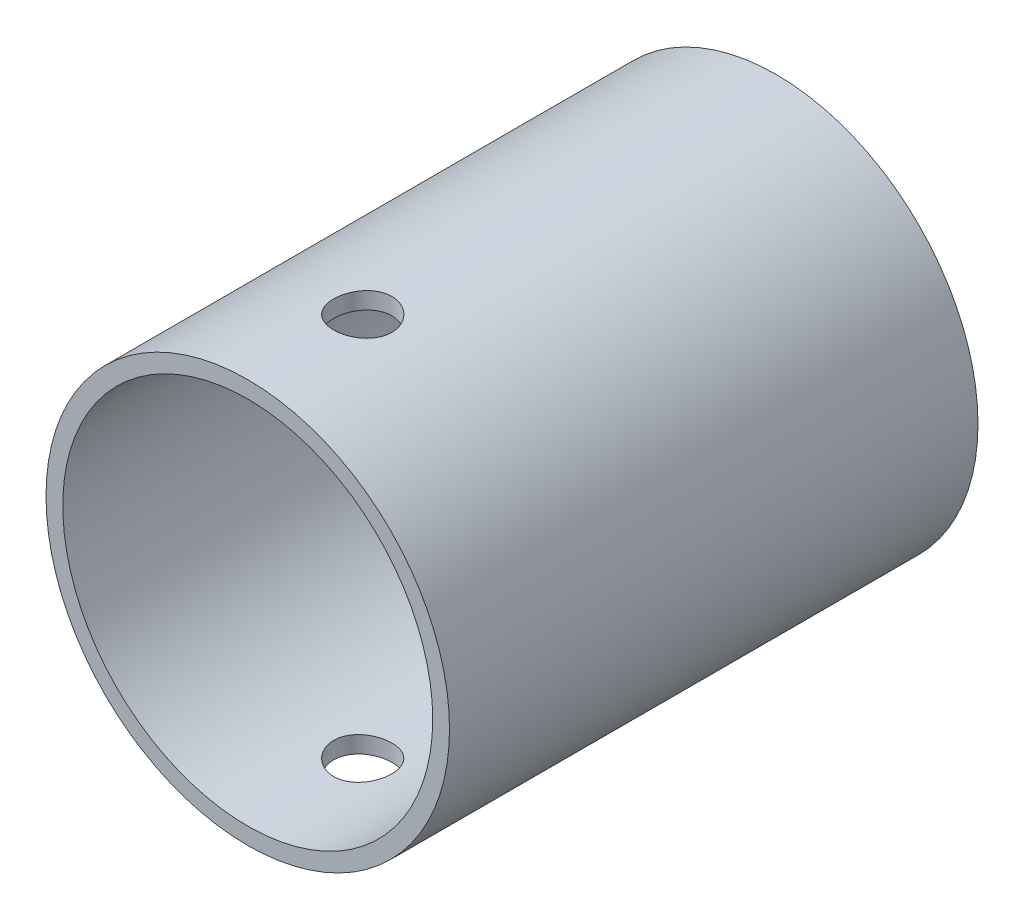
ISO-10303-21;
HEADER;
FILE_DESCRIPTION(('STEP AP214'),'2;1');
FILE_NAME('part.step','',(''),(''),'','','');
FILE_SCHEMA(('AUTOMOTIVE_DESIGN { 1 0 10303 214 1 1 1 1 }'));
ENDSEC;
DATA;
#1=APPLICATION_CONTEXT('core data for automotive mechanical design processes');
#2=APPLICATION_PROTOCOL_DEFINITION('international standard','automotive_design',2000,#1);
#3=PRODUCT_CONTEXT('',#1,'mechanical');
#4=PRODUCT('Part','Part','',(#3));
#5=PRODUCT_RELATED_PRODUCT_CATEGORY('part','',(#4));
#6=PRODUCT_DEFINITION_FORMATION('','',#4);
#7=PRODUCT_DEFINITION_CONTEXT('part definition',#1,'design');
#8=PRODUCT_DEFINITION('design','',#6,#7);
#9=PRODUCT_DEFINITION_SHAPE('','',#8);
#10=(LENGTH_UNIT() NAMED_UNIT(*) SI_UNIT(.MILLI.,.METRE.));
#11=(NAMED_UNIT(*) PLANE_ANGLE_UNIT() SI_UNIT($,.RADIAN.));
#12=(NAMED_UNIT(*) SI_UNIT($,.STERADIAN.) SOLID_ANGLE_UNIT());
#13=UNCERTAINTY_MEASURE_WITH_UNIT(LENGTH_MEASURE(1.E-05),#10,'distance_accuracy_value','');
#14=(GEOMETRIC_REPRESENTATION_CONTEXT(3) GLOBAL_UNCERTAINTY_ASSIGNED_CONTEXT((#13)) GLOBAL_UNIT_ASSIGNED_CONTEXT((#10,
#11,#12)) REPRESENTATION_CONTEXT('',''));
#15=CARTESIAN_POINT('',(0.,0.,0.));
#16=DIRECTION('',(0.,0.,1.));
#17=DIRECTION('',(1.,0.,0.));
#18=AXIS2_PLACEMENT_3D('',#15,#16,#17);
#19=CARTESIAN_POINT('',(0.,0.,6.));
#20=DIRECTION('',(0.,0.,1.));
#21=DIRECTION('',(1.,0.,0.));
#22=AXIS2_PLACEMENT_3D('',#19,#20,#21);
#23=PLANE('',#22);
#24=CARTESIAN_POINT('',(0.,0.,6.));
#25=DIRECTION('',(0.,0.,1.));
#26=DIRECTION('',(1.,0.,0.));
#27=AXIS2_PLACEMENT_3D('',#24,#25,#26);
#28=CIRCLE('',#27,9.);
#29=CARTESIAN_POINT('',(9.,0.,6.));
#30=VERTEX_POINT('',#29);
#31=EDGE_CURVE('E132',#30,#30,#28,.T.);
#32=ORIENTED_EDGE('',*,*,#31,.F.);
#33=EDGE_LOOP('',(#32));
#34=FACE_BOUND('',#33,.T.);
#35=CARTESIAN_POINT('',(0.,0.,6.));
#36=DIRECTION('',(0.,0.,1.));
#37=DIRECTION('',(1.,0.,0.));
#38=AXIS2_PLACEMENT_3D('',#35,#36,#37);
#39=CIRCLE('',#38,10.);
#40=CARTESIAN_POINT('',(10.,0.,6.));
#41=VERTEX_POINT('',#40);
#42=EDGE_CURVE('E54',#41,#41,#39,.F.);
#43=ORIENTED_EDGE('',*,*,#42,.F.);
#44=EDGE_LOOP('',(#43));
#45=FACE_BOUND('',#44,.T.);
#46=ADVANCED_FACE('F34',(#34,#45),#23,.T.);
#47=CARTESIAN_POINT('',(0.,0.,5.));
#48=DIRECTION('',(0.,0.,-1.));
#49=DIRECTION('',(-1.,0.,0.));
#50=AXIS2_PLACEMENT_3D('',#47,#48,#49);
#51=PLANE('',#50);
#52=CARTESIAN_POINT('',(0.,0.,5.));
#53=DIRECTION('',(0.,0.,-1.));
#54=DIRECTION('',(-1.,0.,0.));
#55=AXIS2_PLACEMENT_3D('',#52,#53,#54);
#56=CIRCLE('',#55,6.);
#57=CARTESIAN_POINT('',(-6.,0.,5.));
#58=VERTEX_POINT('',#57);
#59=EDGE_CURVE('E128',#58,#58,#56,.T.);
#60=ORIENTED_EDGE('',*,*,#59,.T.);
#61=EDGE_LOOP('',(#60));
#62=FACE_BOUND('',#61,.T.);
#63=CARTESIAN_POINT('',(0.,0.,5.));
#64=DIRECTION('',(0.,0.,1.));
#65=DIRECTION('',(1.,0.,0.));
#66=AXIS2_PLACEMENT_3D('',#63,#64,#65);
#67=CIRCLE('',#66,9.);
#68=CARTESIAN_POINT('',(9.,0.,5.));
#69=VERTEX_POINT('',#68);
#70=EDGE_CURVE('E137',#69,#69,#67,.T.);
#71=ORIENTED_EDGE('',*,*,#70,.T.);
#72=EDGE_LOOP('',(#71));
#73=FACE_BOUND('',#72,.T.);
#74=ADVANCED_FACE('F92',(#62,#73),#51,.F.);
#75=CARTESIAN_POINT('',(0.,0.,50.));
#76=DIRECTION('',(0.,0.,-1.));
#77=DIRECTION('',(-1.,0.,0.));
#78=AXIS2_PLACEMENT_3D('',#75,#76,#77);
#79=CYLINDRICAL_SURFACE('',#78,17.5);
#80=CARTESIAN_POINT('',(0.,-17.5,41.8700003922223));
#81=CARTESIAN_POINT('',(0.153455229582551,-17.4999974630045,41.8699941337384));
#82=CARTESIAN_POINT('',(0.306997303591635,-17.4979604565219,41.8571123767081));
#83=CARTESIAN_POINT('',(0.609783625449626,-17.4900305238574,41.8059422330934));
#84=CARTESIAN_POINT('',(0.759023644274631,-17.4841339300814,41.767629680265));
#85=CARTESIAN_POINT('',(1.04878062656791,-17.469146941984,41.6667761464509));
#86=CARTESIAN_POINT('',(1.18930431030421,-17.4600590450865,41.6042541072099));
#87=CARTESIAN_POINT('',(1.4578461688781,-17.4396915891876,41.4568040653463));
#88=CARTESIAN_POINT('',(1.58586594948107,-17.4284123121633,41.3718789449507));
#89=CARTESIAN_POINT('',(1.82687936824554,-17.4048070423709,41.1812611533715));
#90=CARTESIAN_POINT('',(1.93975072674967,-17.3924737106769,41.0754147665861));
#91=CARTESIAN_POINT('',(2.14620776085764,-17.368207284657,40.8462898676752));
#92=CARTESIAN_POINT('',(2.23979228333447,-17.3562742142977,40.723010313993));
#93=CARTESIAN_POINT('',(2.40550105052376,-17.3340882849669,40.4616891842459));
#94=CARTESIAN_POINT('',(2.47750588810652,-17.3238449109296,40.323571014526));
#95=CARTESIAN_POINT('',(2.59724804353714,-17.3062990761218,40.0370128344823));
#96=CARTESIAN_POINT('',(2.64498681482154,-17.2989964392188,39.8885734429624));
#97=CARTESIAN_POINT('',(2.71445962258402,-17.2882314601016,39.5868768602009));
#98=CARTESIAN_POINT('',(2.73640375950366,-17.2847381079426,39.4336691765623));
#99=CARTESIAN_POINT('',(2.75431548537907,-17.281893232641,39.12570940022));
#100=CARTESIAN_POINT('',(2.75028470959802,-17.2825414487639,38.9709574053517));
#101=CARTESIAN_POINT('',(2.71653249105086,-17.2878781308041,38.665792501426));
#102=CARTESIAN_POINT('',(2.68704588428737,-17.2925296639804,38.5153528794389));
#103=CARTESIAN_POINT('',(2.60358701785442,-17.3052911276942,38.221583204165));
#104=CARTESIAN_POINT('',(2.54961400397372,-17.3134011647574,38.0782533700192));
#105=CARTESIAN_POINT('',(2.41847274313756,-17.3322062618977,37.8020621568788));
#106=CARTESIAN_POINT('',(2.3412058407861,-17.3429122780869,37.669248398068));
#107=CARTESIAN_POINT('',(2.16574029562039,-17.3656952499611,37.4183824011052));
#108=CARTESIAN_POINT('',(2.06754014737257,-17.3777723042165,37.3003312255872));
#109=CARTESIAN_POINT('',(1.85171057236304,-17.4020993832948,37.0809811054065));
#110=CARTESIAN_POINT('',(1.7338794134433,-17.4143498500481,36.979880598823));
#111=CARTESIAN_POINT('',(1.48281796103276,-17.4375203725031,36.798858256409));
#112=CARTESIAN_POINT('',(1.34958758767357,-17.4484404213039,36.7189365304298));
#113=CARTESIAN_POINT('',(1.07133156137927,-17.4677327717946,36.5825269724027));
#114=CARTESIAN_POINT('',(0.926297820339916,-17.4761033075165,36.5260553737314));
#115=CARTESIAN_POINT('',(0.628644132738795,-17.4893389966959,36.4383264400927));
#116=CARTESIAN_POINT('',(0.476024750473814,-17.4942044104837,36.4070672325438));
#117=CARTESIAN_POINT('',(0.169243780415673,-17.4998469580502,36.3709164208083));
#118=CARTESIAN_POINT('',(0.0151150703929344,-17.5006663632781,36.3657521711964));
#119=CARTESIAN_POINT('',(-0.29180648376779,-17.4982399319457,36.3812128531373));
#120=CARTESIAN_POINT('',(-0.4445993732436,-17.4949942338987,36.401836905985));
#121=CARTESIAN_POINT('',(-0.743679422530946,-17.4848284353516,36.4680620039074));
#122=CARTESIAN_POINT('',(-0.889996919858359,-17.4779280136421,36.5135293219911));
#123=CARTESIAN_POINT('',(-1.17293227179733,-17.4612237098417,36.628008640138));
#124=CARTESIAN_POINT('',(-1.30954963259971,-17.4514196800667,36.697021837825));
#125=CARTESIAN_POINT('',(-1.57039946776912,-17.4298918578239,36.8572671921913));
#126=CARTESIAN_POINT('',(-1.69452514146822,-17.4181534584848,36.9486712014796));
#127=CARTESIAN_POINT('',(-1.92577278652917,-17.3941064929383,37.1508654890616));
#128=CARTESIAN_POINT('',(-2.03289366682977,-17.3817978902109,37.2616570103385));
#129=CARTESIAN_POINT('',(-2.22809077542299,-17.3578626272195,37.5006989512705));
#130=CARTESIAN_POINT('',(-2.31598362633745,-17.3462432437313,37.6290999545737));
#131=CARTESIAN_POINT('',(-2.46895256595108,-17.3251337935183,37.8990037750657));
#132=CARTESIAN_POINT('',(-2.53402931720837,-17.3156436649648,38.0405062116502));
#133=CARTESIAN_POINT('',(-2.63923867768394,-17.2999207265537,38.3320635521373));
#134=CARTESIAN_POINT('',(-2.67946560939592,-17.2936756141117,38.4820837264695));
#135=CARTESIAN_POINT('',(-2.73413229043844,-17.285117855811,38.7868569262007));
#136=CARTESIAN_POINT('',(-2.74857401062851,-17.2828049094027,38.9416095889583));
#137=CARTESIAN_POINT('',(-2.75121005923864,-17.2823853149773,39.2496257804446));
#138=CARTESIAN_POINT('',(-2.73969283943861,-17.2842324406975,39.4028868548955));
#139=CARTESIAN_POINT('',(-2.69135840320221,-17.2918240499717,39.7052627646104));
#140=CARTESIAN_POINT('',(-2.65454124370756,-17.297568524754,39.8543776092054));
#141=CARTESIAN_POINT('',(-2.55675761537021,-17.3122908254171,40.1441351076097));
#142=CARTESIAN_POINT('',(-2.49581326154319,-17.3212656896368,40.2847853844235));
#143=CARTESIAN_POINT('',(-2.35153428014303,-17.3414408094226,40.5539115750985));
#144=CARTESIAN_POINT('',(-2.2681987464252,-17.3526411550466,40.6823869959729));
#145=CARTESIAN_POINT('',(-2.08046265805288,-17.3761530141985,40.9249787203767));
#146=CARTESIAN_POINT('',(-1.97584903731687,-17.3884750087046,41.0389291422424));
#147=CARTESIAN_POINT('',(-1.74897653539545,-17.4127559241292,41.2477584911066));
#148=CARTESIAN_POINT('',(-1.62671357218263,-17.4247147602782,41.3426329939518));
#149=CARTESIAN_POINT('',(-1.36713472210832,-17.4470054845769,41.5111377614422));
#150=CARTESIAN_POINT('',(-1.22973187787683,-17.4573270446582,41.5846354278861));
#151=CARTESIAN_POINT('',(-0.944429950548835,-17.4750794072139,41.7073966727562));
#152=CARTESIAN_POINT('',(-0.796541742404635,-17.4825131544018,41.7566849512202));
#153=CARTESIAN_POINT('',(-0.540021805161799,-17.491986366102,41.8186469990022));
#154=CARTESIAN_POINT('',(-0.432960829499724,-17.4949757850587,41.837874509043));
#155=CARTESIAN_POINT('',(-0.217281069280105,-17.4989834861277,41.8635533300353));
#156=CARTESIAN_POINT('',(-0.108662307045458,-17.5000017964574,41.8700048238817));
#157=CARTESIAN_POINT('',(0.,-17.5,41.8700003922223));
#158=B_SPLINE_CURVE_WITH_KNOTS('',3,(#80,#81,#82,#83,#84,#85,#86,#87,#88,#89,#90,#91,#92,#93,
#94,#95,#96,#97,#98,#99,#100,#101,#102,#103,#104,#105,#106,#107,#108,#109,#110,#111,#112,#113,
#114,#115,#116,#117,#118,#119,#120,#121,#122,#123,#124,#125,#126,#127,#128,#129,#130,#131,#132,
#133,#134,#135,#136,#137,#138,#139,#140,#141,#142,#143,#144,#145,#146,#147,#148,#149,#150,#151,
#152,#153,#154,#155,#156,#157),.UNSPECIFIED.,.T.,.F.,(4,2,2,2,2,2,2,2,2,2,2,2,2,2,2,2,2,2,2,2,2,
2,2,2,2,2,2,2,2,2,2,2,2,2,2,2,2,2,4),(0.,0.459968572164253,0.920374867822618,1.38042166249811,
1.84040929954923,2.30391144436546,2.76744129314947,3.2334905525743,3.69951189429492,
4.1617105385927,4.62388008523577,5.08183102452064,5.5397960702116,5.99972863003873,
6.45969427750327,6.92471667887331,7.38974149220079,7.85508768497432,8.320399312248,
8.78083906741796,9.24126313409204,9.69923288986304,10.1572259430135,10.6188507976519,
11.0805052590953,11.546387163941,12.0122555388924,12.4763445730229,12.9403981335855,
13.3993206543928,13.8582421423223,14.3167439525829,14.7752643206676,15.2386245857692,
15.7020921913456,16.1683761500298,16.6341833812816,16.9598937651968,17.2855994863752),.UNSPECIFIED.);
#159=CARTESIAN_POINT('',(0.,-17.5,41.8700003922223));
#160=VERTEX_POINT('',#159);
#161=EDGE_CURVE('E81',#160,#160,#158,.T.);
#162=ORIENTED_EDGE('',*,*,#161,.F.);
#163=EDGE_LOOP('',(#162));
#164=FACE_BOUND('',#163,.T.);
#165=CARTESIAN_POINT('',(0.,17.5,36.3700003922224));
#166=CARTESIAN_POINT('',(0.153455229582551,17.4999974630045,36.3700066507063));
#167=CARTESIAN_POINT('',(0.306997303591635,17.4979604565219,36.3828884077366));
#168=CARTESIAN_POINT('',(0.609783625449626,17.4900305238574,36.4340585513513));
#169=CARTESIAN_POINT('',(0.759023644274631,17.4841339300814,36.4723711041797));
#170=CARTESIAN_POINT('',(1.04878062656791,17.469146941984,36.5732246379938));
#171=CARTESIAN_POINT('',(1.18930431030421,17.4600590450865,36.6357466772348));
#172=CARTESIAN_POINT('',(1.4578461688781,17.4396915891876,36.7831967190983));
#173=CARTESIAN_POINT('',(1.58586594948107,17.4284123121633,36.868121839494));
#174=CARTESIAN_POINT('',(1.82687936824554,17.4048070423709,37.0587396310732));
#175=CARTESIAN_POINT('',(1.93975072674967,17.3924737106769,37.1645860178586));
#176=CARTESIAN_POINT('',(2.14620776085764,17.368207284657,37.3937109167695));
#177=CARTESIAN_POINT('',(2.23979228333447,17.3562742142977,37.5169904704517));
#178=CARTESIAN_POINT('',(2.40550105052376,17.3340882849669,37.7783116001988));
#179=CARTESIAN_POINT('',(2.47750588810652,17.3238449109296,37.9164297699187));
#180=CARTESIAN_POINT('',(2.59724804353714,17.3062990761218,38.2029879499624));
#181=CARTESIAN_POINT('',(2.64498681482154,17.2989964392188,38.3514273414823));
#182=CARTESIAN_POINT('',(2.71445962258402,17.2882314601016,38.6531239242438));
#183=CARTESIAN_POINT('',(2.73640375950366,17.2847381079426,38.8063316078824));
#184=CARTESIAN_POINT('',(2.75431548537907,17.281893232641,39.1142913842247));
#185=CARTESIAN_POINT('',(2.75028470959802,17.2825414487639,39.269043379093));
#186=CARTESIAN_POINT('',(2.71653249105086,17.2878781308041,39.5742082830187));
#187=CARTESIAN_POINT('',(2.68704588428737,17.2925296639804,39.7246479050058));
#188=CARTESIAN_POINT('',(2.60358701785442,17.3052911276942,40.0184175802797));
#189=CARTESIAN_POINT('',(2.54961400397372,17.3134011647574,40.1617474144255));
#190=CARTESIAN_POINT('',(2.41847274313756,17.3322062618977,40.4379386275659));
#191=CARTESIAN_POINT('',(2.3412058407861,17.3429122780869,40.5707523863767));
#192=CARTESIAN_POINT('',(2.16574029562039,17.3656952499611,40.8216183833395));
#193=CARTESIAN_POINT('',(2.06754014737257,17.3777723042165,40.9396695588575));
#194=CARTESIAN_POINT('',(1.85171057236304,17.4020993832948,41.1590196790382));
#195=CARTESIAN_POINT('',(1.7338794134433,17.4143498500481,41.2601201856217));
#196=CARTESIAN_POINT('',(1.48281796103276,17.4375203725031,41.4411425280357));
#197=CARTESIAN_POINT('',(1.34958758767357,17.4484404213039,41.5210642540149));
#198=CARTESIAN_POINT('',(1.07133156137927,17.4677327717946,41.657473812042));
#199=CARTESIAN_POINT('',(0.926297820339916,17.4761033075165,41.7139454107133));
#200=CARTESIAN_POINT('',(0.628644132738795,17.4893389966959,41.801674344352));
#201=CARTESIAN_POINT('',(0.476024750473814,17.4942044104837,41.8329335519009));
#202=CARTESIAN_POINT('',(0.169243780415673,17.4998469580502,41.8690843636364));
#203=CARTESIAN_POINT('',(0.0151150703929341,17.5006663632781,41.8742486132482));
#204=CARTESIAN_POINT('',(-0.29180648376779,17.4982399319457,41.8587879313074));
#205=CARTESIAN_POINT('',(-0.4445993732436,17.4949942338987,41.8381638784597));
#206=CARTESIAN_POINT('',(-0.743679422530946,17.4848284353516,41.7719387805373));
#207=CARTESIAN_POINT('',(-0.889996919858359,17.4779280136421,41.7264714624536));
#208=CARTESIAN_POINT('',(-1.17293227179733,17.4612237098417,41.6119921443067));
#209=CARTESIAN_POINT('',(-1.30954963259971,17.4514196800667,41.5429789466197));
#210=CARTESIAN_POINT('',(-1.57039946776912,17.4298918578239,41.3827335922534));
#211=CARTESIAN_POINT('',(-1.69452514146822,17.4181534584848,41.2913295829651));
#212=CARTESIAN_POINT('',(-1.92577278652918,17.3941064929383,41.0891352953831));
#213=CARTESIAN_POINT('',(-2.03289366682977,17.3817978902109,40.9783437741062));
#214=CARTESIAN_POINT('',(-2.22809077542299,17.3578626272195,40.7393018331742));
#215=CARTESIAN_POINT('',(-2.31598362633745,17.3462432437313,40.610900829871));
#216=CARTESIAN_POINT('',(-2.46895256595108,17.3251337935183,40.340997009379));
#217=CARTESIAN_POINT('',(-2.53402931720837,17.3156436649648,40.1994945727945));
#218=CARTESIAN_POINT('',(-2.63923867768394,17.2999207265537,39.9079372323074));
#219=CARTESIAN_POINT('',(-2.67946560939592,17.2936756141117,39.7579170579752));
#220=CARTESIAN_POINT('',(-2.73413229043844,17.285117855811,39.453143858244));
#221=CARTESIAN_POINT('',(-2.74857401062851,17.2828049094027,39.2983911954864));
#222=CARTESIAN_POINT('',(-2.75121005923864,17.2823853149773,38.9903750040001));
#223=CARTESIAN_POINT('',(-2.73969283943861,17.2842324406975,38.8371139295492));
#224=CARTESIAN_POINT('',(-2.69135840320221,17.2918240499717,38.5347380198343));
#225=CARTESIAN_POINT('',(-2.65454124370756,17.297568524754,38.3856231752393));
#226=CARTESIAN_POINT('',(-2.55675761537021,17.3122908254171,38.095865676835));
#227=CARTESIAN_POINT('',(-2.49581326154319,17.3212656896368,37.9552154000212));
#228=CARTESIAN_POINT('',(-2.35153428014303,17.3414408094226,37.6860892093462));
#229=CARTESIAN_POINT('',(-2.2681987464252,17.3526411550466,37.5576137884718));
#230=CARTESIAN_POINT('',(-2.08046265805288,17.3761530141985,37.315022064068));
#231=CARTESIAN_POINT('',(-1.97584903731687,17.3884750087046,37.2010716422023));
#232=CARTESIAN_POINT('',(-1.74897653539545,17.4127559241292,36.9922422933381));
#233=CARTESIAN_POINT('',(-1.62671357218263,17.4247147602782,36.8973677904929));
#234=CARTESIAN_POINT('',(-1.36713472210832,17.4470054845769,36.7288630230025));
#235=CARTESIAN_POINT('',(-1.22973187787683,17.4573270446582,36.6553653565586));
#236=CARTESIAN_POINT('',(-0.944429950548835,17.4750794072139,36.5326041116885));
#237=CARTESIAN_POINT('',(-0.796541742404635,17.4825131544018,36.4833158332245));
#238=CARTESIAN_POINT('',(-0.540021805161799,17.491986366102,36.4213537854425));
#239=CARTESIAN_POINT('',(-0.432960829499724,17.4949757850587,36.4021262754017));
#240=CARTESIAN_POINT('',(-0.217281069280105,17.4989834861277,36.3764474544094));
#241=CARTESIAN_POINT('',(-0.108662307045458,17.5000017964574,36.369995960563));
#242=CARTESIAN_POINT('',(0.,17.5,36.3700003922224));
#243=B_SPLINE_CURVE_WITH_KNOTS('',3,(#165,#166,#167,#168,#169,#170,#171,#172,#173,#174,#175,
#176,#177,#178,#179,#180,#181,#182,#183,#184,#185,#186,#187,#188,#189,#190,#191,#192,#193,#194,
#195,#196,#197,#198,#199,#200,#201,#202,#203,#204,#205,#206,#207,#208,#209,#210,#211,#212,#213,
#214,#215,#216,#217,#218,#219,#220,#221,#222,#223,#224,#225,#226,#227,#228,#229,#230,#231,#232,
#233,#234,#235,#236,#237,#238,#239,#240,#241,#242),.UNSPECIFIED.,.T.,.F.,(4,2,2,2,2,2,2,2,2,2,2,
2,2,2,2,2,2,2,2,2,2,2,2,2,2,2,2,2,2,2,2,2,2,2,2,2,2,2,4),(0.,0.459968572164253,
0.920374867822618,1.38042166249811,1.84040929954923,2.30391144436546,2.76744129314947,
3.2334905525743,3.69951189429492,4.16171053859271,4.62388008523577,5.08183102452064,
5.5397960702116,5.99972863003873,6.45969427750327,6.92471667887331,7.38974149220079,
7.85508768497432,8.320399312248,8.78083906741796,9.24126313409204,9.69923288986304,
10.1572259430135,10.6188507976519,11.0805052590953,11.546387163941,12.0122555388924,
12.4763445730229,12.9403981335855,13.3993206543928,13.8582421423222,14.3167439525829,
14.7752643206676,15.2386245857692,15.7020921913456,16.1683761500298,16.6341833812816,
16.9598937651968,17.2855994863752),.UNSPECIFIED.);
#244=CARTESIAN_POINT('',(0.,17.5,36.3700003922224));
#245=VERTEX_POINT('',#244);
#246=EDGE_CURVE('E72',#245,#245,#243,.T.);
#247=ORIENTED_EDGE('',*,*,#246,.F.);
#248=EDGE_LOOP('',(#247));
#249=FACE_BOUND('',#248,.T.);
#250=CARTESIAN_POINT('',(0.,0.,18.));
#251=DIRECTION('',(0.,0.,1.));
#252=DIRECTION('',(1.,0.,0.));
#253=AXIS2_PLACEMENT_3D('',#250,#251,#252);
#254=CIRCLE('',#253,17.5);
#255=CARTESIAN_POINT('',(17.5,0.,18.));
#256=VERTEX_POINT('',#255);
#257=EDGE_CURVE('E50',#256,#256,#254,.T.);
#258=ORIENTED_EDGE('',*,*,#257,.F.);
#259=EDGE_LOOP('',(#258));
#260=FACE_BOUND('',#259,.T.);
#261=CARTESIAN_POINT('',(0.,0.,50.));
#262=DIRECTION('',(0.,0.,1.));
#263=DIRECTION('',(1.,0.,0.));
#264=AXIS2_PLACEMENT_3D('',#261,#262,#263);
#265=CIRCLE('',#264,17.5);
#266=CARTESIAN_POINT('',(17.5,0.,50.));
#267=VERTEX_POINT('',#266);
#268=EDGE_CURVE('E134',#267,#267,#265,.T.);
#269=ORIENTED_EDGE('',*,*,#268,.T.);
#270=EDGE_LOOP('',(#269));
#271=FACE_BOUND('',#270,.T.);
#272=ADVANCED_FACE('F86',(#164,#249,#260,#271),#79,.F.);
#273=CARTESIAN_POINT('',(0.,0.,50.));
#274=DIRECTION('',(0.,0.,1.));
#275=DIRECTION('',(1.,0.,0.));
#276=AXIS2_PLACEMENT_3D('',#273,#274,#275);
#277=PLANE('',#276);
#278=CARTESIAN_POINT('',(0.,0.,50.));
#279=DIRECTION('',(0.,0.,1.));
#280=DIRECTION('',(1.,0.,0.));
#281=AXIS2_PLACEMENT_3D('',#278,#279,#280);
#282=CIRCLE('',#281,19.0875);
#283=CARTESIAN_POINT('',(19.0875,0.,50.));
#284=VERTEX_POINT('',#283);
#285=EDGE_CURVE('E143',#284,#284,#282,.T.);
#286=ORIENTED_EDGE('',*,*,#285,.T.);
#287=EDGE_LOOP('',(#286));
#288=FACE_BOUND('',#287,.T.);
#289=ORIENTED_EDGE('',*,*,#268,.F.);
#290=EDGE_LOOP('',(#289));
#291=FACE_BOUND('',#290,.T.);
#292=ADVANCED_FACE('F91',(#288,#291),#277,.T.);
#293=CARTESIAN_POINT('',(0.,0.,0.));
#294=DIRECTION('',(0.,0.,1.));
#295=DIRECTION('',(1.,0.,0.));
#296=AXIS2_PLACEMENT_3D('',#293,#294,#295);
#297=PLANE('',#296);
#298=CARTESIAN_POINT('',(0.,0.,0.));
#299=DIRECTION('',(0.,0.,1.));
#300=DIRECTION('',(1.,0.,0.));
#301=AXIS2_PLACEMENT_3D('',#298,#299,#300);
#302=CIRCLE('',#301,19.0875);
#303=CARTESIAN_POINT('',(19.0875,0.,0.));
#304=VERTEX_POINT('',#303);
#305=EDGE_CURVE('E142',#304,#304,#302,.T.);
#306=ORIENTED_EDGE('',*,*,#305,.F.);
#307=EDGE_LOOP('',(#306));
#308=FACE_BOUND('',#307,.T.);
#309=CARTESIAN_POINT('',(0.,0.,0.));
#310=DIRECTION('',(0.,0.,-1.));
#311=DIRECTION('',(-1.,0.,0.));
#312=AXIS2_PLACEMENT_3D('',#309,#310,#311);
#313=CIRCLE('',#312,6.);
#314=CARTESIAN_POINT('',(-6.,0.,0.));
#315=VERTEX_POINT('',#314);
#316=EDGE_CURVE('E131',#315,#315,#313,.T.);
#317=ORIENTED_EDGE('',*,*,#316,.F.);
#318=EDGE_LOOP('',(#317));
#319=FACE_BOUND('',#318,.T.);
#320=ADVANCED_FACE('F97',(#308,#319),#297,.F.);
#321=CARTESIAN_POINT('',(0.,0.,50.));
#322=DIRECTION('',(0.,0.,-1.));
#323=DIRECTION('',(-1.,0.,0.));
#324=AXIS2_PLACEMENT_3D('',#321,#322,#323);
#325=CYLINDRICAL_SURFACE('',#324,19.0875);
#326=CARTESIAN_POINT('',(0.,-19.0875,41.8700003922223));
#327=CARTESIAN_POINT('',(0.153615521120521,-19.0874976073508,41.8699940048672));
#328=CARTESIAN_POINT('',(0.307321919414108,-19.0856260886995,41.8570854631101));
#329=CARTESIAN_POINT('',(0.61044325138344,-19.078340322224,41.805802666711));
#330=CARTESIAN_POINT('',(0.759853776449987,-19.0729225616853,41.7674031615706));
#331=CARTESIAN_POINT('',(1.0499523272757,-19.0591535274818,41.6663055363477));
#332=CARTESIAN_POINT('',(1.19064667632898,-19.0508044104449,41.6036252763626));
#333=CARTESIAN_POINT('',(1.45949743002485,-19.0320967554129,41.4557879426475));
#334=CARTESIAN_POINT('',(1.58765567505141,-19.021738513039,41.3706341749872));
#335=CARTESIAN_POINT('',(1.82874567934008,-19.0000819023628,41.1796105408404));
#336=CARTESIAN_POINT('',(1.94157367862009,-18.9887778907905,41.0736103454498));
#337=CARTESIAN_POINT('',(2.14790558010967,-18.9665482758457,40.8441831727678));
#338=CARTESIAN_POINT('',(2.24140840443123,-18.955622693609,40.7207552240657));
#339=CARTESIAN_POINT('',(2.4068354982899,-18.9353320845211,40.4592845205804));
#340=CARTESIAN_POINT('',(2.47866014359806,-18.9259743478301,40.3211781208939));
#341=CARTESIAN_POINT('',(2.59805550551329,-18.909955444476,40.0347050370253));
#342=CARTESIAN_POINT('',(2.64562744099076,-18.9032941423016,39.8863388688949));
#343=CARTESIAN_POINT('',(2.71484640117386,-18.893477480035,39.5846458082018));
#344=CARTESIAN_POINT('',(2.73667050797301,-18.8902981832464,39.4313603374033));
#345=CARTESIAN_POINT('',(2.75432273116317,-18.8877327117754,39.1232723717038));
#346=CARTESIAN_POINT('',(2.75015222628334,-18.8883463359202,38.9684699576946));
#347=CARTESIAN_POINT('',(2.71607848744068,-18.8932754787945,38.6629890180054));
#348=CARTESIAN_POINT('',(2.68637192683781,-18.8975627034194,38.5122880330407));
#349=CARTESIAN_POINT('',(2.60237695257479,-18.9093118080741,38.2180322253942));
#350=CARTESIAN_POINT('',(2.54808789299907,-18.9167737715212,38.0744775905959));
#351=CARTESIAN_POINT('',(2.41626271289395,-18.93406304825,37.797987897475));
#352=CARTESIAN_POINT('',(2.33864274217743,-18.9438988675002,37.6650933710295));
#353=CARTESIAN_POINT('',(2.16241886697989,-18.9648213615543,37.4141409888064));
#354=CARTESIAN_POINT('',(2.06381369054991,-18.9759081121601,37.2960840330492));
#355=CARTESIAN_POINT('',(1.84733623711265,-18.9982084901695,37.0770177086298));
#356=CARTESIAN_POINT('',(1.72929475592141,-19.0094223451599,36.9761754926198));
#357=CARTESIAN_POINT('',(1.47787363335214,-19.03061834793,36.7957081354773));
#358=CARTESIAN_POINT('',(1.34449393387797,-19.0406004910441,36.7160830747123));
#359=CARTESIAN_POINT('',(1.06604169691755,-19.0582176396214,36.5803038517239));
#360=CARTESIAN_POINT('',(0.92096308857828,-19.0658514164373,36.5241619702138));
#361=CARTESIAN_POINT('',(0.623302710085163,-19.0779012587909,36.4370848757042));
#362=CARTESIAN_POINT('',(0.470721408171616,-19.0823175248607,36.4061480917759));
#363=CARTESIAN_POINT('',(0.163830171900698,-19.0874083216805,36.370580216214));
#364=CARTESIAN_POINT('',(0.00954740629092863,-19.0881155545185,36.3657192089349));
#365=CARTESIAN_POINT('',(-0.297630929524714,-19.0857974343763,36.3818314952901));
#366=CARTESIAN_POINT('',(-0.450526539131832,-19.0827721877512,36.4028040528103));
#367=CARTESIAN_POINT('',(-0.749898553796234,-19.0733492726509,36.4697969851133));
#368=CARTESIAN_POINT('',(-0.896400402884331,-19.0669666084194,36.5157059490332));
#369=CARTESIAN_POINT('',(-1.17962713880169,-19.0515424738158,36.6311514399829));
#370=CARTESIAN_POINT('',(-1.31635159731462,-19.0425008870535,36.7006890013397));
#371=CARTESIAN_POINT('',(-1.5771574665485,-19.0226830922841,36.8619614260365));
#372=CARTESIAN_POINT('',(-1.70114736709116,-19.0118955942081,36.9538428649641));
#373=CARTESIAN_POINT('',(-1.93202921337457,-18.9898234846501,37.1569899723744));
#374=CARTESIAN_POINT('',(-2.03892024564451,-18.9785388466503,37.2682566758108));
#375=CARTESIAN_POINT('',(-2.2334014519783,-18.9566413067788,37.5080367511314));
#376=CARTESIAN_POINT('',(-2.32083792662726,-18.9460341957184,37.6366753942108));
#377=CARTESIAN_POINT('',(-2.4728613317025,-18.9267934310252,37.9069486693752));
#378=CARTESIAN_POINT('',(-2.53744884116329,-18.9181597273848,38.0485829720119));
#379=CARTESIAN_POINT('',(-2.6416999885292,-18.9038846687247,38.3403592839205));
#380=CARTESIAN_POINT('',(-2.68144596509198,-18.8982334379287,38.4904713694376));
#381=CARTESIAN_POINT('',(-2.73514871306011,-18.8905364169606,38.7953270816236));
#382=CARTESIAN_POINT('',(-2.74910711604136,-18.8884903986877,38.9500704146446));
#383=CARTESIAN_POINT('',(-2.75080191178507,-18.8882435222291,39.2582648625841));
#384=CARTESIAN_POINT('',(-2.73877990820919,-18.8900072355387,39.4117146754972));
#385=CARTESIAN_POINT('',(-2.68937134673422,-18.8971043105539,39.7143865284613));
#386=CARTESIAN_POINT('',(-2.65198481731345,-18.9024376682515,39.863608573259));
#387=CARTESIAN_POINT('',(-2.5529914660506,-18.9160610713229,40.1535308936064));
#388=CARTESIAN_POINT('',(-2.49140021928185,-18.9243492150551,40.2942365821416));
#389=CARTESIAN_POINT('',(-2.34576966984653,-18.9429508272684,40.5633561231066));
#390=CARTESIAN_POINT('',(-2.26172972649173,-18.953264353552,40.691769624574));
#391=CARTESIAN_POINT('',(-2.07270467337002,-18.974869052824,40.9338891873967));
#392=CARTESIAN_POINT('',(-1.96754028448335,-18.9861680904932,41.0474545967215));
#393=CARTESIAN_POINT('',(-1.73963002813365,-19.0084040647582,41.2554131894042));
#394=CARTESIAN_POINT('',(-1.61688006709496,-19.0193409163123,41.3498018963973));
#395=CARTESIAN_POINT('',(-1.3565560052711,-19.0396830230242,41.5171502173313));
#396=CARTESIAN_POINT('',(-1.21891004789264,-19.0490802495767,41.5899990010265));
#397=CARTESIAN_POINT('',(-0.933269184657702,-19.0652051265391,41.7114368200805));
#398=CARTESIAN_POINT('',(-0.785285318196399,-19.0719355749352,41.7600512960001));
#399=CARTESIAN_POINT('',(-0.530508906074504,-19.080410241401,41.8204565264275));
#400=CARTESIAN_POINT('',(-0.425298265725089,-19.0830554262534,41.8390075181438));
#401=CARTESIAN_POINT('',(-0.213406361091009,-19.0866011270885,41.8637816019122));
#402=CARTESIAN_POINT('',(-0.106725113031621,-19.0875016623044,41.8700048298677));
#403=CARTESIAN_POINT('',(0.,-19.0875,41.8700003922223));
#404=B_SPLINE_CURVE_WITH_KNOTS('',3,(#326,#327,#328,#329,#330,#331,#332,#333,#334,#335,#336,
#337,#338,#339,#340,#341,#342,#343,#344,#345,#346,#347,#348,#349,#350,#351,#352,#353,#354,#355,
#356,#357,#358,#359,#360,#361,#362,#363,#364,#365,#366,#367,#368,#369,#370,#371,#372,#373,#374,
#375,#376,#377,#378,#379,#380,#381,#382,#383,#384,#385,#386,#387,#388,#389,#390,#391,#392,#393,
#394,#395,#396,#397,#398,#399,#400,#401,#402,#403),.UNSPECIFIED.,.T.,.F.,(4,2,2,2,2,2,2,2,2,2,2,
2,2,2,2,2,2,2,2,2,2,2,2,2,2,2,2,2,2,2,2,2,2,2,2,2,2,2,4),(0.,0.460456617825209,0.92137003059068,
1.38194505293461,1.84245235798277,2.3059358668478,2.76944522016562,3.23505333277042,
3.7006380429633,4.16300164846519,4.62534073085565,5.08415055582128,5.54297243690893,
6.00346342962956,6.46398234144444,6.92874575399378,7.39351092697263,7.85851884959101,
8.32349778798203,8.78437008706609,9.24522925413426,9.70404613115434,10.1628830951827,
10.624815311634,11.0867721976,11.5522584710578,12.0177329473982,12.4816562844754,
12.9455502681874,13.4051488661451,13.864746948084,14.3240497741987,14.7833657102664,
15.2467583167256,15.7102589676787,16.1761045663354,16.6414600968217,16.9613680461405,
17.2812724687216),.UNSPECIFIED.);
#405=CARTESIAN_POINT('',(0.,-19.0875,41.8700003922223));
#406=VERTEX_POINT('',#405);
#407=EDGE_CURVE('E10',#406,#406,#404,.T.);
#408=ORIENTED_EDGE('',*,*,#407,.T.);
#409=EDGE_LOOP('',(#408));
#410=FACE_BOUND('',#409,.T.);
#411=CARTESIAN_POINT('',(0.,19.0875,36.3700003922224));
#412=CARTESIAN_POINT('',(0.153615521120521,19.0874976073508,36.3700067795775));
#413=CARTESIAN_POINT('',(0.307321919414108,19.0856260886995,36.3829153213346));
#414=CARTESIAN_POINT('',(0.61044325138344,19.078340322224,36.4341981177337));
#415=CARTESIAN_POINT('',(0.759853776449987,19.0729225616853,36.4725976228741));
#416=CARTESIAN_POINT('',(1.0499523272757,19.0591535274818,36.573695248097));
#417=CARTESIAN_POINT('',(1.19064667632898,19.0508044104449,36.6363755080821));
#418=CARTESIAN_POINT('',(1.45949743002485,19.0320967554129,36.7842128417972));
#419=CARTESIAN_POINT('',(1.58765567505141,19.021738513039,36.8693666094575));
#420=CARTESIAN_POINT('',(1.82874567934008,19.0000819023628,37.0603902436043));
#421=CARTESIAN_POINT('',(1.94157367862009,18.9887778907905,37.1663904389949));
#422=CARTESIAN_POINT('',(2.14790558010967,18.9665482758457,37.3958176116769));
#423=CARTESIAN_POINT('',(2.24140840443123,18.955622693609,37.5192455603789));
#424=CARTESIAN_POINT('',(2.4068354982899,18.9353320845211,37.7807162638643));
#425=CARTESIAN_POINT('',(2.47866014359806,18.9259743478301,37.9188226635508));
#426=CARTESIAN_POINT('',(2.59805550551329,18.909955444476,38.2052957474194));
#427=CARTESIAN_POINT('',(2.64562744099076,18.9032941423016,38.3536619155498));
#428=CARTESIAN_POINT('',(2.71484640117386,18.893477480035,38.6553549762429));
#429=CARTESIAN_POINT('',(2.73667050797301,18.8902981832464,38.8086404470414));
#430=CARTESIAN_POINT('',(2.75432273116317,18.8877327117754,39.1167284127409));
#431=CARTESIAN_POINT('',(2.75015222628334,18.8883463359202,39.2715308267501));
#432=CARTESIAN_POINT('',(2.71607848744068,18.8932754787945,39.5770117664392));
#433=CARTESIAN_POINT('',(2.68637192683781,18.8975627034194,39.727712751404));
#434=CARTESIAN_POINT('',(2.60237695257479,18.9093118080741,40.0219685590505));
#435=CARTESIAN_POINT('',(2.54808789299907,18.9167737715212,40.1655231938488));
#436=CARTESIAN_POINT('',(2.41626271289395,18.93406304825,40.4420128869697));
#437=CARTESIAN_POINT('',(2.33864274217743,18.9438988675002,40.5749074134152));
#438=CARTESIAN_POINT('',(2.16241886697989,18.9648213615543,40.8258597956383));
#439=CARTESIAN_POINT('',(2.06381369054991,18.9759081121601,40.9439167513954));
#440=CARTESIAN_POINT('',(1.84733623711265,18.9982084901695,41.1629830758149));
#441=CARTESIAN_POINT('',(1.72929475592141,19.0094223451599,41.2638252918249));
#442=CARTESIAN_POINT('',(1.47787363335214,19.03061834793,41.4442926489674));
#443=CARTESIAN_POINT('',(1.34449393387797,19.0406004910441,41.5239177097324));
#444=CARTESIAN_POINT('',(1.06604169691755,19.0582176396214,41.6596969327208));
#445=CARTESIAN_POINT('',(0.92096308857828,19.0658514164373,41.7158388142309));
#446=CARTESIAN_POINT('',(0.623302710085163,19.0779012587909,41.8029159087405));
#447=CARTESIAN_POINT('',(0.470721408171616,19.0823175248607,41.8338526926688));
#448=CARTESIAN_POINT('',(0.163830171900698,19.0874083216805,41.8694205682307));
#449=CARTESIAN_POINT('',(0.00954740629092863,19.0881155545185,41.8742815755098));
#450=CARTESIAN_POINT('',(-0.297630929524714,19.0857974343763,41.8581692891546));
#451=CARTESIAN_POINT('',(-0.450526539131832,19.0827721877512,41.8371967316344));
#452=CARTESIAN_POINT('',(-0.749898553796234,19.0733492726509,41.7702037993314));
#453=CARTESIAN_POINT('',(-0.896400402884331,19.0669666084194,41.7242948354115));
#454=CARTESIAN_POINT('',(-1.17962713880169,19.0515424738158,41.6088493444618));
#455=CARTESIAN_POINT('',(-1.31635159731462,19.0425008870535,41.539311783105));
#456=CARTESIAN_POINT('',(-1.5771574665485,19.0226830922841,41.3780393584082));
#457=CARTESIAN_POINT('',(-1.70114736709116,19.0118955942081,41.2861579194806));
#458=CARTESIAN_POINT('',(-1.93202921337457,18.9898234846501,41.0830108120703));
#459=CARTESIAN_POINT('',(-2.03892024564451,18.9785388466503,40.9717441086339));
#460=CARTESIAN_POINT('',(-2.2334014519783,18.9566413067788,40.7319640333133));
#461=CARTESIAN_POINT('',(-2.32083792662726,18.9460341957184,40.6033253902339));
#462=CARTESIAN_POINT('',(-2.4728613317025,18.9267934310252,40.3330521150695));
#463=CARTESIAN_POINT('',(-2.53744884116329,18.9181597273848,40.1914178124328));
#464=CARTESIAN_POINT('',(-2.6416999885292,18.9038846687247,39.8996415005242));
#465=CARTESIAN_POINT('',(-2.68144596509198,18.8982334379287,39.7495294150071));
#466=CARTESIAN_POINT('',(-2.73514871306011,18.8905364169606,39.4446737028211));
#467=CARTESIAN_POINT('',(-2.74910711604136,18.8884903986877,39.2899303698001));
#468=CARTESIAN_POINT('',(-2.75080191178507,18.8882435222291,38.9817359218606));
#469=CARTESIAN_POINT('',(-2.73877990820919,18.8900072355387,38.8282861089475));
#470=CARTESIAN_POINT('',(-2.68937134673422,18.8971043105539,38.5256142559833));
#471=CARTESIAN_POINT('',(-2.65198481731345,18.9024376682515,38.3763922111857));
#472=CARTESIAN_POINT('',(-2.5529914660506,18.9160610713229,38.0864698908383));
#473=CARTESIAN_POINT('',(-2.49140021928185,18.9243492150551,37.9457642023031));
#474=CARTESIAN_POINT('',(-2.34576966984653,18.9429508272684,37.6766446613381));
#475=CARTESIAN_POINT('',(-2.26172972649173,18.953264353552,37.5482311598707));
#476=CARTESIAN_POINT('',(-2.07270467337002,18.974869052824,37.306111597048));
#477=CARTESIAN_POINT('',(-1.96754028448335,18.9861680904932,37.1925461877232));
#478=CARTESIAN_POINT('',(-1.73963002813365,19.0084040647582,36.9845875950405));
#479=CARTESIAN_POINT('',(-1.61688006709496,19.0193409163123,36.8901988880474));
#480=CARTESIAN_POINT('',(-1.3565560052711,19.0396830230242,36.7228505671134));
#481=CARTESIAN_POINT('',(-1.21891004789264,19.0490802495767,36.6500017834182));
#482=CARTESIAN_POINT('',(-0.933269184657702,19.0652051265391,36.5285639643642));
#483=CARTESIAN_POINT('',(-0.785285318196399,19.0719355749352,36.4799494884446));
#484=CARTESIAN_POINT('',(-0.530508906074504,19.080410241401,36.4195442580171));
#485=CARTESIAN_POINT('',(-0.425298265725089,19.0830554262534,36.4009932663009));
#486=CARTESIAN_POINT('',(-0.213406361091009,19.0866011270885,36.3762191825325));
#487=CARTESIAN_POINT('',(-0.106725113031621,19.0875016623044,36.369995954577));
#488=CARTESIAN_POINT('',(0.,19.0875,36.3700003922224));
#489=B_SPLINE_CURVE_WITH_KNOTS('',3,(#411,#412,#413,#414,#415,#416,#417,#418,#419,#420,#421,
#422,#423,#424,#425,#426,#427,#428,#429,#430,#431,#432,#433,#434,#435,#436,#437,#438,#439,#440,
#441,#442,#443,#444,#445,#446,#447,#448,#449,#450,#451,#452,#453,#454,#455,#456,#457,#458,#459,
#460,#461,#462,#463,#464,#465,#466,#467,#468,#469,#470,#471,#472,#473,#474,#475,#476,#477,#478,
#479,#480,#481,#482,#483,#484,#485,#486,#487,#488),.UNSPECIFIED.,.T.,.F.,(4,2,2,2,2,2,2,2,2,2,2,
2,2,2,2,2,2,2,2,2,2,2,2,2,2,2,2,2,2,2,2,2,2,2,2,2,2,2,4),(0.,0.460456617825209,0.92137003059068,
1.3819450529346,1.84245235798277,2.3059358668478,2.76944522016562,3.23505333277042,
3.7006380429633,4.16300164846519,4.62534073085565,5.08415055582128,5.54297243690893,
6.00346342962957,6.46398234144444,6.92874575399378,7.39351092697263,7.85851884959101,
8.32349778798203,8.78437008706609,9.24522925413426,9.70404613115434,10.1628830951827,
10.624815311634,11.0867721976,11.5522584710578,12.0177329473982,12.4816562844754,
12.9455502681874,13.4051488661451,13.864746948084,14.3240497741987,14.7833657102664,
15.2467583167256,15.7102589676787,16.1761045663354,16.6414600968217,16.9613680461405,
17.2812724687216),.UNSPECIFIED.);
#490=CARTESIAN_POINT('',(0.,19.0875,36.3700003922224));
#491=VERTEX_POINT('',#490);
#492=EDGE_CURVE('E46',#491,#491,#489,.T.);
#493=ORIENTED_EDGE('',*,*,#492,.T.);
#494=EDGE_LOOP('',(#493));
#495=FACE_BOUND('',#494,.T.);
#496=ORIENTED_EDGE('',*,*,#285,.F.);
#497=EDGE_LOOP('',(#496));
#498=FACE_BOUND('',#497,.T.);
#499=ORIENTED_EDGE('',*,*,#305,.T.);
#500=EDGE_LOOP('',(#499));
#501=FACE_BOUND('',#500,.T.);
#502=ADVANCED_FACE('F36',(#410,#495,#498,#501),#325,.T.);
#503=CARTESIAN_POINT('',(0.,0.,5.));
#504=DIRECTION('',(0.,0.,-1.));
#505=DIRECTION('',(-1.,0.,0.));
#506=AXIS2_PLACEMENT_3D('',#503,#504,#505);
#507=CYLINDRICAL_SURFACE('',#506,6.);
#508=ORIENTED_EDGE('',*,*,#59,.F.);
#509=EDGE_LOOP('',(#508));
#510=FACE_BOUND('',#509,.T.);
#511=ORIENTED_EDGE('',*,*,#316,.T.);
#512=EDGE_LOOP('',(#511));
#513=FACE_BOUND('',#512,.T.);
#514=ADVANCED_FACE('F104',(#510,#513),#507,.F.);
#515=CARTESIAN_POINT('',(0.,0.,6.));
#516=DIRECTION('',(0.,0.,-1.));
#517=DIRECTION('',(-1.,0.,0.));
#518=AXIS2_PLACEMENT_3D('',#515,#516,#517);
#519=CYLINDRICAL_SURFACE('',#518,9.);
#520=ORIENTED_EDGE('',*,*,#31,.T.);
#521=EDGE_LOOP('',(#520));
#522=FACE_BOUND('',#521,.T.);
#523=ORIENTED_EDGE('',*,*,#70,.F.);
#524=EDGE_LOOP('',(#523));
#525=FACE_BOUND('',#524,.T.);
#526=ADVANCED_FACE('F117',(#522,#525),#519,.F.);
#527=CARTESIAN_POINT('',(0.,0.,18.));
#528=DIRECTION('',(0.,0.,1.));
#529=DIRECTION('',(1.,0.,0.));
#530=AXIS2_PLACEMENT_3D('',#527,#528,#529);
#531=PLANE('',#530);
#532=ORIENTED_EDGE('',*,*,#257,.T.);
#533=EDGE_LOOP('',(#532));
#534=FACE_BOUND('',#533,.T.);
#535=CARTESIAN_POINT('',(0.,0.,18.));
#536=DIRECTION('',(0.,0.,1.));
#537=DIRECTION('',(1.,0.,0.));
#538=AXIS2_PLACEMENT_3D('',#535,#536,#537);
#539=CIRCLE('',#538,10.);
#540=CARTESIAN_POINT('',(10.,0.,18.));
#541=VERTEX_POINT('',#540);
#542=EDGE_CURVE('E80',#541,#541,#539,.T.);
#543=ORIENTED_EDGE('',*,*,#542,.F.);
#544=EDGE_LOOP('',(#543));
#545=FACE_BOUND('',#544,.T.);
#546=ADVANCED_FACE('F123',(#534,#545),#531,.T.);
#547=CARTESIAN_POINT('',(0.,0.,18.));
#548=DIRECTION('',(0.,0.,-1.));
#549=DIRECTION('',(-1.,0.,0.));
#550=AXIS2_PLACEMENT_3D('',#547,#548,#549);
#551=CYLINDRICAL_SURFACE('',#550,10.);
#552=ORIENTED_EDGE('',*,*,#542,.T.);
#553=EDGE_LOOP('',(#552));
#554=FACE_BOUND('',#553,.T.);
#555=ORIENTED_EDGE('',*,*,#42,.T.);
#556=EDGE_LOOP('',(#555));
#557=FACE_BOUND('',#556,.T.);
#558=ADVANCED_FACE('F66',(#554,#557),#551,.F.);
#559=CARTESIAN_POINT('',(0.,0.,39.1200003922223));
#560=DIRECTION('',(0.,-1.,0.));
#561=DIRECTION('',(0.,0.,-1.));
#562=AXIS2_PLACEMENT_3D('',#559,#560,#561);
#563=CYLINDRICAL_SURFACE('',#562,2.74999999999999);
#564=ORIENTED_EDGE('',*,*,#246,.T.);
#565=EDGE_LOOP('',(#564));
#566=FACE_BOUND('',#565,.T.);
#567=ORIENTED_EDGE('',*,*,#492,.F.);
#568=EDGE_LOOP('',(#567));
#569=FACE_BOUND('',#568,.T.);
#570=ADVANCED_FACE('F61',(#566,#569),#563,.F.);
#571=CARTESIAN_POINT('',(0.,0.,39.1200003922223));
#572=DIRECTION('',(0.,1.,0.));
#573=DIRECTION('',(0.,0.,1.));
#574=AXIS2_PLACEMENT_3D('',#571,#572,#573);
#575=CYLINDRICAL_SURFACE('',#574,2.74999999999999);
#576=ORIENTED_EDGE('',*,*,#161,.T.);
#577=EDGE_LOOP('',(#576));
#578=FACE_BOUND('',#577,.T.);
#579=ORIENTED_EDGE('',*,*,#407,.F.);
#580=EDGE_LOOP('',(#579));
#581=FACE_BOUND('',#580,.T.);
#582=ADVANCED_FACE('F65',(#578,#581),#575,.F.);
#583=CLOSED_SHELL('',(#46,#74,#272,#292,#320,#502,#514,#526,#546,#558,#570,#582));
#584=MANIFOLD_SOLID_BREP('B2',#583);
#585=ADVANCED_BREP_SHAPE_REPRESENTATION('',(#18,#584),#14);
#586=SHAPE_DEFINITION_REPRESENTATION(#9,#585);
ENDSEC;
END-ISO-10303-21;
